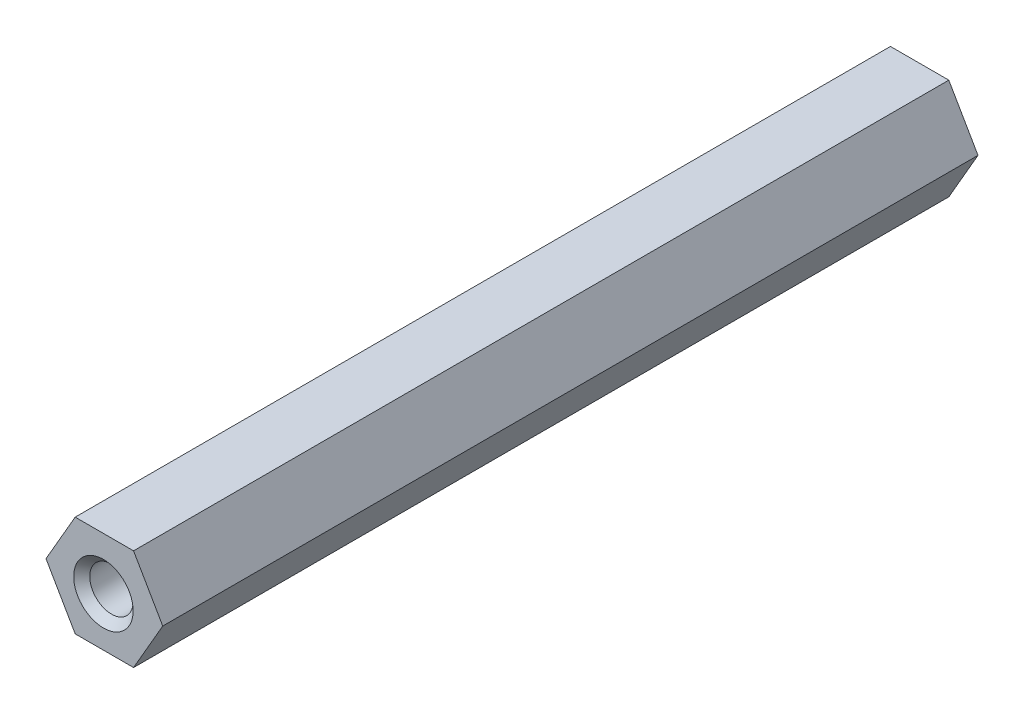
ISO-10303-21;
HEADER;
FILE_DESCRIPTION(('STEP AP214'),'2;1');
FILE_NAME('part.step','',(''),(''),'','','');
FILE_SCHEMA(('AUTOMOTIVE_DESIGN { 1 0 10303 214 1 1 1 1 }'));
ENDSEC;
DATA;
#1=APPLICATION_CONTEXT('core data for automotive mechanical design processes');
#2=APPLICATION_PROTOCOL_DEFINITION('international standard','automotive_design',2000,#1);
#3=PRODUCT_CONTEXT('',#1,'mechanical');
#4=PRODUCT('Part','Part','',(#3));
#5=PRODUCT_RELATED_PRODUCT_CATEGORY('part','',(#4));
#6=PRODUCT_DEFINITION_FORMATION('','',#4);
#7=PRODUCT_DEFINITION_CONTEXT('part definition',#1,'design');
#8=PRODUCT_DEFINITION('design','',#6,#7);
#9=PRODUCT_DEFINITION_SHAPE('','',#8);
#10=(LENGTH_UNIT() NAMED_UNIT(*) SI_UNIT(.MILLI.,.METRE.));
#11=(NAMED_UNIT(*) PLANE_ANGLE_UNIT() SI_UNIT($,.RADIAN.));
#12=(NAMED_UNIT(*) SI_UNIT($,.STERADIAN.) SOLID_ANGLE_UNIT());
#13=UNCERTAINTY_MEASURE_WITH_UNIT(LENGTH_MEASURE(1.E-05),#10,'distance_accuracy_value','');
#14=(GEOMETRIC_REPRESENTATION_CONTEXT(3) GLOBAL_UNCERTAINTY_ASSIGNED_CONTEXT((#13)) GLOBAL_UNIT_ASSIGNED_CONTEXT((#10,
#11,#12)) REPRESENTATION_CONTEXT('',''));
#15=CARTESIAN_POINT('',(0.,0.,0.));
#16=DIRECTION('',(0.,0.,1.));
#17=DIRECTION('',(1.,0.,0.));
#18=AXIS2_PLACEMENT_3D('',#15,#16,#17);
#19=CARTESIAN_POINT('',(3.63730669589464,0.,-25.4));
#20=DIRECTION('',(0.,0.,1.));
#21=DIRECTION('',(1.,0.,0.));
#22=AXIS2_PLACEMENT_3D('',#19,#20,#21);
#23=PLANE('',#22);
#24=DIRECTION('',(0.5,0.866025403784438,0.));
#25=VECTOR('',#24,1.);
#26=CARTESIAN_POINT('',(1.81865334794732,-3.15,-25.4));
#27=LINE('',#26,#25);
#28=CARTESIAN_POINT('',(1.81865334794732,-3.15,-25.4));
#29=VERTEX_POINT('',#28);
#30=CARTESIAN_POINT('',(3.63730669589464,0.,-25.4));
#31=VERTEX_POINT('',#30);
#32=EDGE_CURVE('E150',#29,#31,#27,.T.);
#33=ORIENTED_EDGE('',*,*,#32,.F.);
#34=DIRECTION('',(1.,0.,0.));
#35=VECTOR('',#34,1.);
#36=CARTESIAN_POINT('',(-1.81865334794732,-3.15,-25.4));
#37=LINE('',#36,#35);
#38=CARTESIAN_POINT('',(-1.81865334794732,-3.15,-25.4));
#39=VERTEX_POINT('',#38);
#40=EDGE_CURVE('E113',#39,#29,#37,.T.);
#41=ORIENTED_EDGE('',*,*,#40,.F.);
#42=DIRECTION('',(0.5,-0.866025403784439,0.));
#43=VECTOR('',#42,1.);
#44=CARTESIAN_POINT('',(-3.63730669589464,0.,-25.4));
#45=LINE('',#44,#43);
#46=CARTESIAN_POINT('',(-3.63730669589464,0.,-25.4));
#47=VERTEX_POINT('',#46);
#48=EDGE_CURVE('E97',#47,#39,#45,.T.);
#49=ORIENTED_EDGE('',*,*,#48,.F.);
#50=DIRECTION('',(-0.5,-0.866025403784438,0.));
#51=VECTOR('',#50,1.);
#52=CARTESIAN_POINT('',(-1.81865334794732,3.15,-25.4));
#53=LINE('',#52,#51);
#54=CARTESIAN_POINT('',(-1.81865334794732,3.15,-25.4));
#55=VERTEX_POINT('',#54);
#56=EDGE_CURVE('E111',#55,#47,#53,.T.);
#57=ORIENTED_EDGE('',*,*,#56,.F.);
#58=DIRECTION('',(-1.,0.,0.));
#59=VECTOR('',#58,1.);
#60=CARTESIAN_POINT('',(1.81865334794732,3.15,-25.4));
#61=LINE('',#60,#59);
#62=CARTESIAN_POINT('',(1.81865334794732,3.15,-25.4));
#63=VERTEX_POINT('',#62);
#64=EDGE_CURVE('E118',#63,#55,#61,.T.);
#65=ORIENTED_EDGE('',*,*,#64,.F.);
#66=DIRECTION('',(-0.5,0.866025403784438,0.));
#67=VECTOR('',#66,1.);
#68=CARTESIAN_POINT('',(3.63730669589464,0.,-25.4));
#69=LINE('',#68,#67);
#70=EDGE_CURVE('E123',#31,#63,#69,.T.);
#71=ORIENTED_EDGE('',*,*,#70,.F.);
#72=EDGE_LOOP('',(#33,#41,#49,#57,#65,#71));
#73=FACE_BOUND('',#72,.T.);
#74=CARTESIAN_POINT('',(-0.0587533379232065,-0.101763766397256,-25.4));
#75=DIRECTION('',(0.,0.,1.));
#76=DIRECTION('',(1.,0.,0.));
#77=AXIS2_PLACEMENT_3D('',#74,#75,#76);
#78=CIRCLE('',#77,1.85254999999999);
#79=CARTESIAN_POINT('',(1.79379666207678,-0.101763766397256,-25.4));
#80=VERTEX_POINT('',#79);
#81=EDGE_CURVE('E346',#80,#80,#78,.T.);
#82=ORIENTED_EDGE('',*,*,#81,.T.);
#83=EDGE_LOOP('',(#82));
#84=FACE_BOUND('',#83,.T.);
#85=ADVANCED_FACE('F16',(#73,#84),#23,.F.);
#86=CARTESIAN_POINT('',(3.63730669589464,0.,25.4));
#87=DIRECTION('',(0.,0.,1.));
#88=DIRECTION('',(1.,0.,0.));
#89=AXIS2_PLACEMENT_3D('',#86,#87,#88);
#90=PLANE('',#89);
#91=DIRECTION('',(0.5,0.866025403784438,0.));
#92=VECTOR('',#91,1.);
#93=CARTESIAN_POINT('',(1.81865334794732,-3.15,25.4));
#94=LINE('',#93,#92);
#95=CARTESIAN_POINT('',(1.81865334794732,-3.15,25.4));
#96=VERTEX_POINT('',#95);
#97=CARTESIAN_POINT('',(3.63730669589464,0.,25.4));
#98=VERTEX_POINT('',#97);
#99=EDGE_CURVE('E129',#96,#98,#94,.T.);
#100=ORIENTED_EDGE('',*,*,#99,.T.);
#101=DIRECTION('',(-0.5,0.866025403784438,0.));
#102=VECTOR('',#101,1.);
#103=CARTESIAN_POINT('',(3.63730669589464,0.,25.4));
#104=LINE('',#103,#102);
#105=CARTESIAN_POINT('',(1.81865334794732,3.15,25.4));
#106=VERTEX_POINT('',#105);
#107=EDGE_CURVE('E133',#98,#106,#104,.T.);
#108=ORIENTED_EDGE('',*,*,#107,.T.);
#109=DIRECTION('',(-1.,0.,0.));
#110=VECTOR('',#109,1.);
#111=CARTESIAN_POINT('',(1.81865334794732,3.15,25.4));
#112=LINE('',#111,#110);
#113=CARTESIAN_POINT('',(-1.81865334794732,3.15,25.4));
#114=VERTEX_POINT('',#113);
#115=EDGE_CURVE('E138',#106,#114,#112,.T.);
#116=ORIENTED_EDGE('',*,*,#115,.T.);
#117=DIRECTION('',(-0.5,-0.866025403784438,0.));
#118=VECTOR('',#117,1.);
#119=CARTESIAN_POINT('',(-1.81865334794732,3.15,25.4));
#120=LINE('',#119,#118);
#121=CARTESIAN_POINT('',(-3.63730669589464,0.,25.4));
#122=VERTEX_POINT('',#121);
#123=EDGE_CURVE('E142',#114,#122,#120,.T.);
#124=ORIENTED_EDGE('',*,*,#123,.T.);
#125=DIRECTION('',(0.5,-0.866025403784439,0.));
#126=VECTOR('',#125,1.);
#127=CARTESIAN_POINT('',(-3.63730669589464,0.,25.4));
#128=LINE('',#127,#126);
#129=CARTESIAN_POINT('',(-1.81865334794732,-3.15,25.4));
#130=VERTEX_POINT('',#129);
#131=EDGE_CURVE('E99',#122,#130,#128,.T.);
#132=ORIENTED_EDGE('',*,*,#131,.T.);
#133=DIRECTION('',(1.,0.,0.));
#134=VECTOR('',#133,1.);
#135=CARTESIAN_POINT('',(-1.81865334794732,-3.15,25.4));
#136=LINE('',#135,#134);
#137=EDGE_CURVE('E147',#130,#96,#136,.T.);
#138=ORIENTED_EDGE('',*,*,#137,.T.);
#139=EDGE_LOOP('',(#100,#108,#116,#124,#132,#138));
#140=FACE_BOUND('',#139,.T.);
#141=CARTESIAN_POINT('',(-0.0587533379232065,-0.101763766397256,25.4));
#142=DIRECTION('',(0.,0.,1.));
#143=DIRECTION('',(1.,0.,0.));
#144=AXIS2_PLACEMENT_3D('',#141,#142,#143);
#145=CIRCLE('',#144,1.85254999999998);
#146=CARTESIAN_POINT('',(1.79379666207677,-0.101763766397256,25.4));
#147=VERTEX_POINT('',#146);
#148=EDGE_CURVE('E207',#147,#147,#145,.F.);
#149=ORIENTED_EDGE('',*,*,#148,.T.);
#150=EDGE_LOOP('',(#149));
#151=FACE_BOUND('',#150,.T.);
#152=ADVANCED_FACE('F163',(#140,#151),#90,.T.);
#153=CARTESIAN_POINT('',(1.81865334794732,-3.15,-25.4));
#154=DIRECTION('',(0.866025403784439,-0.5,0.));
#155=DIRECTION('',(0.5,0.866025403784439,0.));
#156=AXIS2_PLACEMENT_3D('',#153,#154,#155);
#157=PLANE('',#156);
#158=ORIENTED_EDGE('',*,*,#99,.F.);
#159=DIRECTION('',(0.,0.,1.));
#160=VECTOR('',#159,1.);
#161=CARTESIAN_POINT('',(1.81865334794732,-3.15,-25.4));
#162=LINE('',#161,#160);
#163=EDGE_CURVE('E10',#29,#96,#162,.T.);
#164=ORIENTED_EDGE('',*,*,#163,.F.);
#165=ORIENTED_EDGE('',*,*,#32,.T.);
#166=DIRECTION('',(0.,0.,1.));
#167=VECTOR('',#166,1.);
#168=CARTESIAN_POINT('',(3.63730669589464,0.,-25.4));
#169=LINE('',#168,#167);
#170=EDGE_CURVE('E20',#31,#98,#169,.T.);
#171=ORIENTED_EDGE('',*,*,#170,.T.);
#172=EDGE_LOOP('',(#158,#164,#165,#171));
#173=FACE_BOUND('',#172,.T.);
#174=ADVANCED_FACE('F18',(#173),#157,.T.);
#175=CARTESIAN_POINT('',(-1.81865334794732,-3.15,-25.4));
#176=DIRECTION('',(0.,-1.,0.));
#177=DIRECTION('',(1.,0.,0.));
#178=AXIS2_PLACEMENT_3D('',#175,#176,#177);
#179=PLANE('',#178);
#180=ORIENTED_EDGE('',*,*,#137,.F.);
#181=DIRECTION('',(0.,0.,1.));
#182=VECTOR('',#181,1.);
#183=CARTESIAN_POINT('',(-1.81865334794732,-3.15,-25.4));
#184=LINE('',#183,#182);
#185=EDGE_CURVE('E27',#39,#130,#184,.T.);
#186=ORIENTED_EDGE('',*,*,#185,.F.);
#187=ORIENTED_EDGE('',*,*,#40,.T.);
#188=ORIENTED_EDGE('',*,*,#163,.T.);
#189=EDGE_LOOP('',(#180,#186,#187,#188));
#190=FACE_BOUND('',#189,.T.);
#191=ADVANCED_FACE('F165',(#190),#179,.T.);
#192=CARTESIAN_POINT('',(-3.63730669589464,0.,-25.4));
#193=DIRECTION('',(-0.866025403784439,-0.5,0.));
#194=DIRECTION('',(0.5,-0.866025403784439,0.));
#195=AXIS2_PLACEMENT_3D('',#192,#193,#194);
#196=PLANE('',#195);
#197=ORIENTED_EDGE('',*,*,#131,.F.);
#198=DIRECTION('',(0.,0.,1.));
#199=VECTOR('',#198,1.);
#200=CARTESIAN_POINT('',(-3.63730669589464,0.,-25.4));
#201=LINE('',#200,#199);
#202=EDGE_CURVE('E94',#47,#122,#201,.T.);
#203=ORIENTED_EDGE('',*,*,#202,.F.);
#204=ORIENTED_EDGE('',*,*,#48,.T.);
#205=ORIENTED_EDGE('',*,*,#185,.T.);
#206=EDGE_LOOP('',(#197,#203,#204,#205));
#207=FACE_BOUND('',#206,.T.);
#208=ADVANCED_FACE('F96',(#207),#196,.T.);
#209=CARTESIAN_POINT('',(-1.81865334794732,3.15,-25.4));
#210=DIRECTION('',(-0.866025403784439,0.5,0.));
#211=DIRECTION('',(-0.5,-0.866025403784439,0.));
#212=AXIS2_PLACEMENT_3D('',#209,#210,#211);
#213=PLANE('',#212);
#214=ORIENTED_EDGE('',*,*,#123,.F.);
#215=DIRECTION('',(0.,0.,1.));
#216=VECTOR('',#215,1.);
#217=CARTESIAN_POINT('',(-1.81865334794732,3.15,-25.4));
#218=LINE('',#217,#216);
#219=EDGE_CURVE('E105',#55,#114,#218,.T.);
#220=ORIENTED_EDGE('',*,*,#219,.F.);
#221=ORIENTED_EDGE('',*,*,#56,.T.);
#222=ORIENTED_EDGE('',*,*,#202,.T.);
#223=EDGE_LOOP('',(#214,#220,#221,#222));
#224=FACE_BOUND('',#223,.T.);
#225=ADVANCED_FACE('F116',(#224),#213,.T.);
#226=CARTESIAN_POINT('',(1.81865334794732,3.15,-25.4));
#227=DIRECTION('',(0.,1.,0.));
#228=DIRECTION('',(0.,0.,1.));
#229=AXIS2_PLACEMENT_3D('',#226,#227,#228);
#230=PLANE('',#229);
#231=ORIENTED_EDGE('',*,*,#115,.F.);
#232=DIRECTION('',(0.,0.,1.));
#233=VECTOR('',#232,1.);
#234=CARTESIAN_POINT('',(1.81865334794732,3.15,-25.4));
#235=LINE('',#234,#233);
#236=EDGE_CURVE('E155',#63,#106,#235,.T.);
#237=ORIENTED_EDGE('',*,*,#236,.F.);
#238=ORIENTED_EDGE('',*,*,#64,.T.);
#239=ORIENTED_EDGE('',*,*,#219,.T.);
#240=EDGE_LOOP('',(#231,#237,#238,#239));
#241=FACE_BOUND('',#240,.T.);
#242=ADVANCED_FACE('F215',(#241),#230,.T.);
#243=CARTESIAN_POINT('',(3.63730669589464,0.,-25.4));
#244=DIRECTION('',(0.866025403784438,0.5,0.));
#245=DIRECTION('',(-0.5,0.866025403784438,0.));
#246=AXIS2_PLACEMENT_3D('',#243,#244,#245);
#247=PLANE('',#246);
#248=ORIENTED_EDGE('',*,*,#107,.F.);
#249=ORIENTED_EDGE('',*,*,#170,.F.);
#250=ORIENTED_EDGE('',*,*,#70,.T.);
#251=ORIENTED_EDGE('',*,*,#236,.T.);
#252=EDGE_LOOP('',(#248,#249,#250,#251));
#253=FACE_BOUND('',#252,.T.);
#254=ADVANCED_FACE('F161',(#253),#247,.T.);
#255=CARTESIAN_POINT('',(-0.0587533379232065,-0.101763766397256,24.9));
#256=DIRECTION('',(0.,0.,1.));
#257=DIRECTION('',(1.,0.,0.));
#258=AXIS2_PLACEMENT_3D('',#255,#256,#257);
#259=CONICAL_SURFACE('',#258,1.35254999999999,0.785398163397456);
#260=ORIENTED_EDGE('',*,*,#148,.F.);
#261=EDGE_LOOP('',(#260));
#262=FACE_BOUND('',#261,.T.);
#263=CARTESIAN_POINT('',(-0.0587533379232065,-0.101763766397256,24.9));
#264=DIRECTION('',(0.,0.,1.));
#265=DIRECTION('',(1.,0.,0.));
#266=AXIS2_PLACEMENT_3D('',#263,#264,#265);
#267=CIRCLE('',#266,1.35254999999999);
#268=CARTESIAN_POINT('',(1.29379666207678,-0.101763766397256,24.9));
#269=VERTEX_POINT('',#268);
#270=EDGE_CURVE('E134',#269,#269,#267,.T.);
#271=ORIENTED_EDGE('',*,*,#270,.F.);
#272=EDGE_LOOP('',(#271));
#273=FACE_BOUND('',#272,.T.);
#274=ADVANCED_FACE('F181',(#262,#273),#259,.F.);
#275=CARTESIAN_POINT('',(-0.0587533379232065,-0.101763766397256,-25.4));
#276=DIRECTION('',(0.,0.,-1.));
#277=DIRECTION('',(-1.,0.,0.));
#278=AXIS2_PLACEMENT_3D('',#275,#276,#277);
#279=CONICAL_SURFACE('',#278,1.85254999999999,0.785398163397439);
#280=CARTESIAN_POINT('',(-0.0587533379232065,-0.101763766397256,-24.9));
#281=DIRECTION('',(0.,0.,1.));
#282=DIRECTION('',(1.,0.,0.));
#283=AXIS2_PLACEMENT_3D('',#280,#281,#282);
#284=CIRCLE('',#283,1.35254999999999);
#285=CARTESIAN_POINT('',(1.29379666207678,-0.101763766397256,-24.9));
#286=VERTEX_POINT('',#285);
#287=EDGE_CURVE('E197',#286,#286,#284,.F.);
#288=ORIENTED_EDGE('',*,*,#287,.F.);
#289=EDGE_LOOP('',(#288));
#290=FACE_BOUND('',#289,.T.);
#291=ORIENTED_EDGE('',*,*,#81,.F.);
#292=EDGE_LOOP('',(#291));
#293=FACE_BOUND('',#292,.T.);
#294=ADVANCED_FACE('F184',(#290,#293),#279,.F.);
#295=CARTESIAN_POINT('',(-0.0587533379232065,-0.101763766397256,25.4));
#296=DIRECTION('',(0.,0.,1.));
#297=DIRECTION('',(1.,0.,0.));
#298=AXIS2_PLACEMENT_3D('',#295,#296,#297);
#299=CYLINDRICAL_SURFACE('',#298,1.35254999999999);
#300=ORIENTED_EDGE('',*,*,#287,.T.);
#301=EDGE_LOOP('',(#300));
#302=FACE_BOUND('',#301,.T.);
#303=ORIENTED_EDGE('',*,*,#270,.T.);
#304=EDGE_LOOP('',(#303));
#305=FACE_BOUND('',#304,.T.);
#306=ADVANCED_FACE('F188',(#302,#305),#299,.F.);
#307=CLOSED_SHELL('',(#85,#152,#174,#191,#208,#225,#242,#254,#274,#294,#306));
#308=MANIFOLD_SOLID_BREP('B1',#307);
#309=ADVANCED_BREP_SHAPE_REPRESENTATION('',(#18,#308),#14);
#310=SHAPE_DEFINITION_REPRESENTATION(#9,#309);
ENDSEC;
END-ISO-10303-21;
